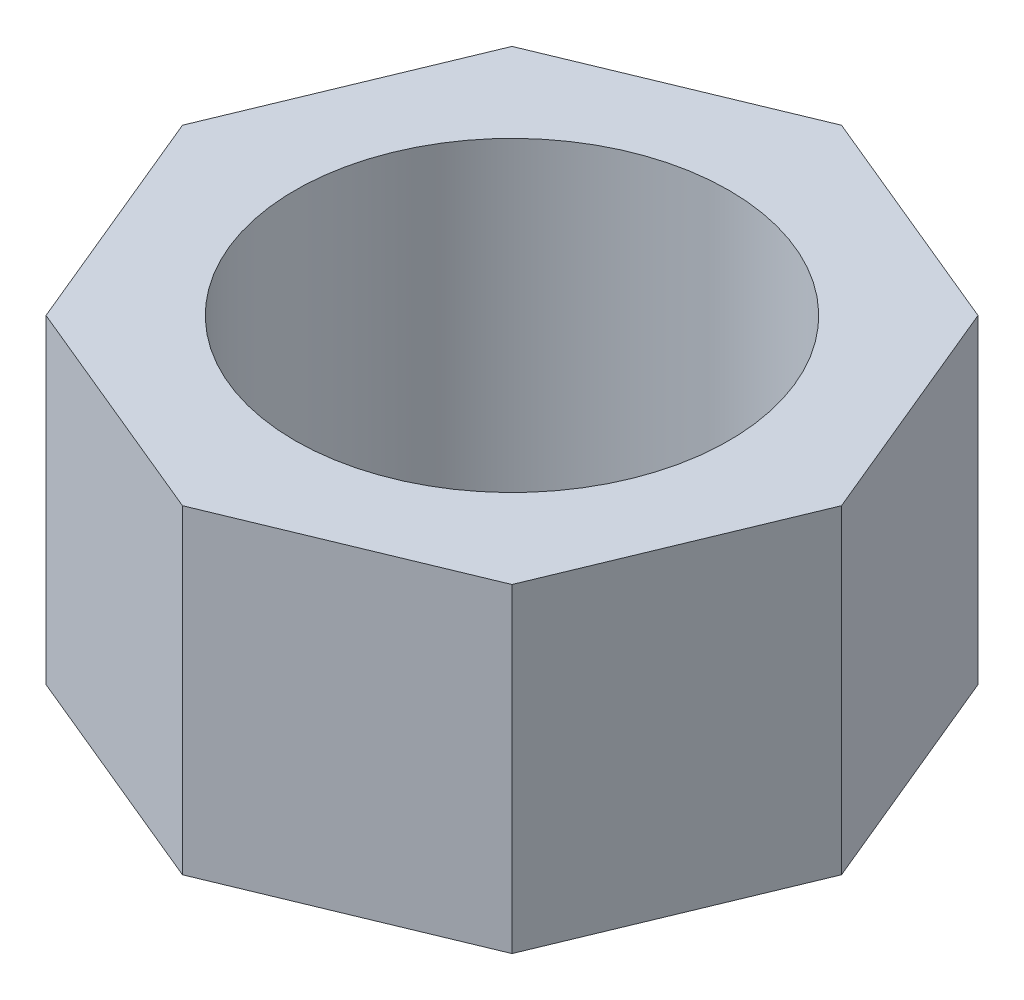
ISO-10303-21;
HEADER;
FILE_DESCRIPTION(('STEP AP214'),'2;1');
FILE_NAME('part.step','',(''),(''),'','','');
FILE_SCHEMA(('AUTOMOTIVE_DESIGN { 1 0 10303 214 1 1 1 1 }'));
ENDSEC;
DATA;
#1=APPLICATION_CONTEXT('core data for automotive mechanical design processes');
#2=APPLICATION_PROTOCOL_DEFINITION('international standard','automotive_design',2000,#1);
#3=PRODUCT_CONTEXT('',#1,'mechanical');
#4=PRODUCT('Part','Part','',(#3));
#5=PRODUCT_RELATED_PRODUCT_CATEGORY('part','',(#4));
#6=PRODUCT_DEFINITION_FORMATION('','',#4);
#7=PRODUCT_DEFINITION_CONTEXT('part definition',#1,'design');
#8=PRODUCT_DEFINITION('design','',#6,#7);
#9=PRODUCT_DEFINITION_SHAPE('','',#8);
#10=(LENGTH_UNIT() NAMED_UNIT(*) SI_UNIT(.MILLI.,.METRE.));
#11=(NAMED_UNIT(*) PLANE_ANGLE_UNIT() SI_UNIT($,.RADIAN.));
#12=(NAMED_UNIT(*) SI_UNIT($,.STERADIAN.) SOLID_ANGLE_UNIT());
#13=UNCERTAINTY_MEASURE_WITH_UNIT(LENGTH_MEASURE(1.E-05),#10,'distance_accuracy_value','');
#14=(GEOMETRIC_REPRESENTATION_CONTEXT(3) GLOBAL_UNCERTAINTY_ASSIGNED_CONTEXT((#13)) GLOBAL_UNIT_ASSIGNED_CONTEXT((#10,
#11,#12)) REPRESENTATION_CONTEXT('',''));
#15=CARTESIAN_POINT('',(0.,0.,0.));
#16=DIRECTION('',(0.,0.,1.));
#17=DIRECTION('',(1.,0.,0.));
#18=AXIS2_PLACEMENT_3D('',#15,#16,#17);
#19=CARTESIAN_POINT('',(7.39103626009029,8.4,-3.06146745892071));
#20=DIRECTION('',(-0.923879532511287,0.,0.382683432365089));
#21=DIRECTION('',(0.382683432365089,0.,0.923879532511287));
#22=AXIS2_PLACEMENT_3D('',#19,#20,#21);
#23=PLANE('',#22);
#24=DIRECTION('',(-0.382683432365089,0.,-0.923879532511287));
#25=VECTOR('',#24,1.);
#26=CARTESIAN_POINT('',(7.39103626009029,0.,-3.06146745892071));
#27=LINE('',#26,#25);
#28=CARTESIAN_POINT('',(8.65913760233915,0.,0.));
#29=VERTEX_POINT('',#28);
#30=CARTESIAN_POINT('',(6.12293491784144,0.,-6.12293491784143));
#31=VERTEX_POINT('',#30);
#32=EDGE_CURVE('E137',#29,#31,#27,.T.);
#33=ORIENTED_EDGE('',*,*,#32,.T.);
#34=DIRECTION('',(0.,-1.,0.));
#35=VECTOR('',#34,1.);
#36=CARTESIAN_POINT('',(6.12293491784144,8.4,-6.12293491784143));
#37=LINE('',#36,#35);
#38=CARTESIAN_POINT('',(6.12293491784144,8.4,-6.12293491784143));
#39=VERTEX_POINT('',#38);
#40=EDGE_CURVE('E11',#39,#31,#37,.T.);
#41=ORIENTED_EDGE('',*,*,#40,.F.);
#42=DIRECTION('',(-0.382683432365089,0.,-0.923879532511287));
#43=VECTOR('',#42,1.);
#44=CARTESIAN_POINT('',(7.39103626009029,8.4,-3.06146745892071));
#45=LINE('',#44,#43);
#46=CARTESIAN_POINT('',(8.65913760233915,8.4,0.));
#47=VERTEX_POINT('',#46);
#48=EDGE_CURVE('E183',#47,#39,#45,.T.);
#49=ORIENTED_EDGE('',*,*,#48,.F.);
#50=DIRECTION('',(0.,-1.,0.));
#51=VECTOR('',#50,1.);
#52=CARTESIAN_POINT('',(8.65913760233915,8.4,0.));
#53=LINE('',#52,#51);
#54=EDGE_CURVE('E130',#47,#29,#53,.T.);
#55=ORIENTED_EDGE('',*,*,#54,.T.);
#56=EDGE_LOOP('',(#33,#41,#49,#55));
#57=FACE_BOUND('',#56,.T.);
#58=ADVANCED_FACE('F37',(#57),#23,.F.);
#59=CARTESIAN_POINT('',(3.06146745892066,8.4,-7.39103626009029));
#60=DIRECTION('',(-0.382683432365084,0.,0.923879532511289));
#61=DIRECTION('',(0.923879532511289,0.,0.382683432365084));
#62=AXIS2_PLACEMENT_3D('',#59,#60,#61);
#63=PLANE('',#62);
#64=DIRECTION('',(-0.923879532511289,0.,-0.382683432365084));
#65=VECTOR('',#64,1.);
#66=CARTESIAN_POINT('',(3.06146745892066,0.,-7.39103626009029));
#67=LINE('',#66,#65);
#68=CARTESIAN_POINT('',(-1.1145598333151E-13,0.,-8.65913760233915));
#69=VERTEX_POINT('',#68);
#70=EDGE_CURVE('E140',#31,#69,#67,.T.);
#71=ORIENTED_EDGE('',*,*,#70,.T.);
#72=DIRECTION('',(0.,-1.,0.));
#73=VECTOR('',#72,1.);
#74=CARTESIAN_POINT('',(-1.1145598333151E-13,8.4,-8.65913760233915));
#75=LINE('',#74,#73);
#76=CARTESIAN_POINT('',(-1.1145598333151E-13,8.4,-8.65913760233915));
#77=VERTEX_POINT('',#76);
#78=EDGE_CURVE('E46',#77,#69,#75,.T.);
#79=ORIENTED_EDGE('',*,*,#78,.F.);
#80=DIRECTION('',(-0.923879532511289,0.,-0.382683432365084));
#81=VECTOR('',#80,1.);
#82=CARTESIAN_POINT('',(3.06146745892066,8.4,-7.39103626009029));
#83=LINE('',#82,#81);
#84=EDGE_CURVE('E97',#39,#77,#83,.T.);
#85=ORIENTED_EDGE('',*,*,#84,.F.);
#86=ORIENTED_EDGE('',*,*,#40,.T.);
#87=EDGE_LOOP('',(#71,#79,#85,#86));
#88=FACE_BOUND('',#87,.T.);
#89=ADVANCED_FACE('F201',(#88),#63,.F.);
#90=CARTESIAN_POINT('',(-3.06146745892077,8.4,-7.39103626009029));
#91=DIRECTION('',(0.382683432365096,0.,0.923879532511285));
#92=DIRECTION('',(0.923879532511284,0.,-0.382683432365096));
#93=AXIS2_PLACEMENT_3D('',#90,#91,#92);
#94=PLANE('',#93);
#95=DIRECTION('',(-0.923879532511284,0.,0.382683432365096));
#96=VECTOR('',#95,1.);
#97=CARTESIAN_POINT('',(-3.06146745892077,0.,-7.39103626009029));
#98=LINE('',#97,#96);
#99=CARTESIAN_POINT('',(-6.12293491784143,0.,-6.12293491784144));
#100=VERTEX_POINT('',#99);
#101=EDGE_CURVE('E142',#69,#100,#98,.T.);
#102=ORIENTED_EDGE('',*,*,#101,.T.);
#103=DIRECTION('',(0.,-1.,0.));
#104=VECTOR('',#103,1.);
#105=CARTESIAN_POINT('',(-6.12293491784143,8.4,-6.12293491784144));
#106=LINE('',#105,#104);
#107=CARTESIAN_POINT('',(-6.12293491784143,8.4,-6.12293491784144));
#108=VERTEX_POINT('',#107);
#109=EDGE_CURVE('E158',#108,#100,#106,.T.);
#110=ORIENTED_EDGE('',*,*,#109,.F.);
#111=DIRECTION('',(-0.923879532511284,0.,0.382683432365096));
#112=VECTOR('',#111,1.);
#113=CARTESIAN_POINT('',(-3.06146745892077,8.4,-7.39103626009029));
#114=LINE('',#113,#112);
#115=EDGE_CURVE('E166',#77,#108,#114,.T.);
#116=ORIENTED_EDGE('',*,*,#115,.F.);
#117=ORIENTED_EDGE('',*,*,#78,.T.);
#118=EDGE_LOOP('',(#102,#110,#116,#117));
#119=FACE_BOUND('',#118,.T.);
#120=ADVANCED_FACE('F164',(#119),#94,.F.);
#121=CARTESIAN_POINT('',(-7.39103626009029,8.4,-3.06146745892072));
#122=DIRECTION('',(0.923879532511287,0.,0.38268343236509));
#123=DIRECTION('',(0.38268343236509,0.,-0.923879532511287));
#124=AXIS2_PLACEMENT_3D('',#121,#122,#123);
#125=PLANE('',#124);
#126=DIRECTION('',(-0.38268343236509,0.,0.923879532511287));
#127=VECTOR('',#126,1.);
#128=CARTESIAN_POINT('',(-7.39103626009029,0.,-3.06146745892072));
#129=LINE('',#128,#127);
#130=CARTESIAN_POINT('',(-8.65913760233915,0.,0.));
#131=VERTEX_POINT('',#130);
#132=EDGE_CURVE('E144',#100,#131,#129,.T.);
#133=ORIENTED_EDGE('',*,*,#132,.T.);
#134=DIRECTION('',(0.,-1.,0.));
#135=VECTOR('',#134,1.);
#136=CARTESIAN_POINT('',(-8.65913760233915,8.4,0.));
#137=LINE('',#136,#135);
#138=CARTESIAN_POINT('',(-8.65913760233915,8.4,0.));
#139=VERTEX_POINT('',#138);
#140=EDGE_CURVE('E155',#139,#131,#137,.T.);
#141=ORIENTED_EDGE('',*,*,#140,.F.);
#142=DIRECTION('',(-0.38268343236509,0.,0.923879532511287));
#143=VECTOR('',#142,1.);
#144=CARTESIAN_POINT('',(-7.39103626009029,8.4,-3.06146745892072));
#145=LINE('',#144,#143);
#146=EDGE_CURVE('E178',#108,#139,#145,.T.);
#147=ORIENTED_EDGE('',*,*,#146,.F.);
#148=ORIENTED_EDGE('',*,*,#109,.T.);
#149=EDGE_LOOP('',(#133,#141,#147,#148));
#150=FACE_BOUND('',#149,.T.);
#151=ADVANCED_FACE('F174',(#150),#125,.F.);
#152=CARTESIAN_POINT('',(-7.39103626009029,8.4,3.06146745892072));
#153=DIRECTION('',(0.923879532511287,0.,-0.38268343236509));
#154=DIRECTION('',(-0.38268343236509,0.,-0.923879532511287));
#155=AXIS2_PLACEMENT_3D('',#152,#153,#154);
#156=PLANE('',#155);
#157=DIRECTION('',(0.38268343236509,0.,0.923879532511287));
#158=VECTOR('',#157,1.);
#159=CARTESIAN_POINT('',(-7.39103626009029,0.,3.06146745892072));
#160=LINE('',#159,#158);
#161=CARTESIAN_POINT('',(-6.12293491784143,0.,6.12293491784143));
#162=VERTEX_POINT('',#161);
#163=EDGE_CURVE('E146',#131,#162,#160,.T.);
#164=ORIENTED_EDGE('',*,*,#163,.T.);
#165=DIRECTION('',(0.,-1.,0.));
#166=VECTOR('',#165,1.);
#167=CARTESIAN_POINT('',(-6.12293491784143,8.4,6.12293491784143));
#168=LINE('',#167,#166);
#169=CARTESIAN_POINT('',(-6.12293491784143,8.4,6.12293491784143));
#170=VERTEX_POINT('',#169);
#171=EDGE_CURVE('E125',#170,#162,#168,.T.);
#172=ORIENTED_EDGE('',*,*,#171,.F.);
#173=DIRECTION('',(0.38268343236509,0.,0.923879532511287));
#174=VECTOR('',#173,1.);
#175=CARTESIAN_POINT('',(-7.39103626009029,8.4,3.06146745892072));
#176=LINE('',#175,#174);
#177=EDGE_CURVE('E116',#139,#170,#176,.T.);
#178=ORIENTED_EDGE('',*,*,#177,.F.);
#179=ORIENTED_EDGE('',*,*,#140,.T.);
#180=EDGE_LOOP('',(#164,#172,#178,#179));
#181=FACE_BOUND('',#180,.T.);
#182=ADVANCED_FACE('F177',(#181),#156,.F.);
#183=CARTESIAN_POINT('',(-3.06146745892072,8.4,7.39103626009029));
#184=DIRECTION('',(0.38268343236509,0.,-0.923879532511287));
#185=DIRECTION('',(-0.923879532511287,0.,-0.38268343236509));
#186=AXIS2_PLACEMENT_3D('',#183,#184,#185);
#187=PLANE('',#186);
#188=DIRECTION('',(0.923879532511287,0.,0.38268343236509));
#189=VECTOR('',#188,1.);
#190=CARTESIAN_POINT('',(-3.06146745892072,0.,7.39103626009029));
#191=LINE('',#190,#189);
#192=CARTESIAN_POINT('',(0.,0.,8.65913760233915));
#193=VERTEX_POINT('',#192);
#194=EDGE_CURVE('E124',#162,#193,#191,.T.);
#195=ORIENTED_EDGE('',*,*,#194,.T.);
#196=DIRECTION('',(0.,-1.,0.));
#197=VECTOR('',#196,1.);
#198=CARTESIAN_POINT('',(0.,8.4,8.65913760233915));
#199=LINE('',#198,#197);
#200=CARTESIAN_POINT('',(0.,8.4,8.65913760233915));
#201=VERTEX_POINT('',#200);
#202=EDGE_CURVE('E121',#201,#193,#199,.T.);
#203=ORIENTED_EDGE('',*,*,#202,.F.);
#204=DIRECTION('',(0.923879532511287,0.,0.38268343236509));
#205=VECTOR('',#204,1.);
#206=CARTESIAN_POINT('',(-3.06146745892072,8.4,7.39103626009029));
#207=LINE('',#206,#205);
#208=EDGE_CURVE('E110',#170,#201,#207,.T.);
#209=ORIENTED_EDGE('',*,*,#208,.F.);
#210=ORIENTED_EDGE('',*,*,#171,.T.);
#211=EDGE_LOOP('',(#195,#203,#209,#210));
#212=FACE_BOUND('',#211,.T.);
#213=ADVANCED_FACE('F122',(#212),#187,.F.);
#214=CARTESIAN_POINT('',(3.06146745892071,8.4,7.39103626009029));
#215=DIRECTION('',(-0.38268343236509,0.,-0.923879532511287));
#216=DIRECTION('',(-0.923879532511287,0.,0.38268343236509));
#217=AXIS2_PLACEMENT_3D('',#214,#215,#216);
#218=PLANE('',#217);
#219=DIRECTION('',(0.923879532511287,0.,-0.38268343236509));
#220=VECTOR('',#219,1.);
#221=CARTESIAN_POINT('',(3.06146745892071,0.,7.39103626009029));
#222=LINE('',#221,#220);
#223=CARTESIAN_POINT('',(6.12293491784143,0.,6.12293491784143));
#224=VERTEX_POINT('',#223);
#225=EDGE_CURVE('E83',#193,#224,#222,.T.);
#226=ORIENTED_EDGE('',*,*,#225,.T.);
#227=DIRECTION('',(0.,-1.,0.));
#228=VECTOR('',#227,1.);
#229=CARTESIAN_POINT('',(6.12293491784143,8.4,6.12293491784143));
#230=LINE('',#229,#228);
#231=CARTESIAN_POINT('',(6.12293491784143,8.4,6.12293491784143));
#232=VERTEX_POINT('',#231);
#233=EDGE_CURVE('E126',#232,#224,#230,.T.);
#234=ORIENTED_EDGE('',*,*,#233,.F.);
#235=DIRECTION('',(0.923879532511287,0.,-0.38268343236509));
#236=VECTOR('',#235,1.);
#237=CARTESIAN_POINT('',(3.06146745892071,8.4,7.39103626009029));
#238=LINE('',#237,#236);
#239=EDGE_CURVE('E114',#201,#232,#238,.T.);
#240=ORIENTED_EDGE('',*,*,#239,.F.);
#241=ORIENTED_EDGE('',*,*,#202,.T.);
#242=EDGE_LOOP('',(#226,#234,#240,#241));
#243=FACE_BOUND('',#242,.T.);
#244=ADVANCED_FACE('F128',(#243),#218,.F.);
#245=CARTESIAN_POINT('',(0.,8.4,0.));
#246=DIRECTION('',(0.,-1.,0.));
#247=DIRECTION('',(0.,0.,-1.));
#248=AXIS2_PLACEMENT_3D('',#245,#246,#247);
#249=CYLINDRICAL_SURFACE('',#248,5.7);
#250=CARTESIAN_POINT('',(0.,8.4,0.));
#251=DIRECTION('',(0.,1.,0.));
#252=DIRECTION('',(0.,0.,1.));
#253=AXIS2_PLACEMENT_3D('',#250,#251,#252);
#254=CIRCLE('',#253,5.7);
#255=CARTESIAN_POINT('',(0.,8.4,5.7));
#256=VERTEX_POINT('',#255);
#257=EDGE_CURVE('E151',#256,#256,#254,.T.);
#258=ORIENTED_EDGE('',*,*,#257,.T.);
#259=EDGE_LOOP('',(#258));
#260=FACE_BOUND('',#259,.T.);
#261=CARTESIAN_POINT('',(0.,0.,0.));
#262=DIRECTION('',(0.,1.,0.));
#263=DIRECTION('',(0.,0.,1.));
#264=AXIS2_PLACEMENT_3D('',#261,#262,#263);
#265=CIRCLE('',#264,5.7);
#266=CARTESIAN_POINT('',(0.,0.,5.7));
#267=VERTEX_POINT('',#266);
#268=EDGE_CURVE('E134',#267,#267,#265,.T.);
#269=ORIENTED_EDGE('',*,*,#268,.F.);
#270=EDGE_LOOP('',(#269));
#271=FACE_BOUND('',#270,.T.);
#272=ADVANCED_FACE('F39',(#260,#271),#249,.F.);
#273=CARTESIAN_POINT('',(7.39103626009029,8.4,3.06146745892072));
#274=DIRECTION('',(-0.923879532511287,0.,-0.38268343236509));
#275=DIRECTION('',(-0.38268343236509,0.,0.923879532511287));
#276=AXIS2_PLACEMENT_3D('',#273,#274,#275);
#277=PLANE('',#276);
#278=DIRECTION('',(0.38268343236509,0.,-0.923879532511287));
#279=VECTOR('',#278,1.);
#280=CARTESIAN_POINT('',(7.39103626009029,0.,3.06146745892072));
#281=LINE('',#280,#279);
#282=EDGE_CURVE('E89',#224,#29,#281,.T.);
#283=ORIENTED_EDGE('',*,*,#282,.T.);
#284=ORIENTED_EDGE('',*,*,#54,.F.);
#285=DIRECTION('',(0.38268343236509,0.,-0.923879532511287));
#286=VECTOR('',#285,1.);
#287=CARTESIAN_POINT('',(7.39103626009029,8.4,3.06146745892072));
#288=LINE('',#287,#286);
#289=EDGE_CURVE('E54',#232,#47,#288,.T.);
#290=ORIENTED_EDGE('',*,*,#289,.F.);
#291=ORIENTED_EDGE('',*,*,#233,.T.);
#292=EDGE_LOOP('',(#283,#284,#290,#291));
#293=FACE_BOUND('',#292,.T.);
#294=ADVANCED_FACE('F191',(#293),#277,.F.);
#295=CARTESIAN_POINT('',(0.,8.4,0.));
#296=DIRECTION('',(0.,1.,0.));
#297=DIRECTION('',(0.,0.,1.));
#298=AXIS2_PLACEMENT_3D('',#295,#296,#297);
#299=PLANE('',#298);
#300=ORIENTED_EDGE('',*,*,#257,.F.);
#301=EDGE_LOOP('',(#300));
#302=FACE_BOUND('',#301,.T.);
#303=ORIENTED_EDGE('',*,*,#48,.T.);
#304=ORIENTED_EDGE('',*,*,#84,.T.);
#305=ORIENTED_EDGE('',*,*,#115,.T.);
#306=ORIENTED_EDGE('',*,*,#146,.T.);
#307=ORIENTED_EDGE('',*,*,#177,.T.);
#308=ORIENTED_EDGE('',*,*,#208,.T.);
#309=ORIENTED_EDGE('',*,*,#239,.T.);
#310=ORIENTED_EDGE('',*,*,#289,.T.);
#311=EDGE_LOOP('',(#303,#304,#305,#306,#307,#308,#309,#310));
#312=FACE_BOUND('',#311,.T.);
#313=ADVANCED_FACE('F112',(#302,#312),#299,.T.);
#314=CARTESIAN_POINT('',(0.,0.,0.));
#315=DIRECTION('',(0.,1.,0.));
#316=DIRECTION('',(0.,0.,1.));
#317=AXIS2_PLACEMENT_3D('',#314,#315,#316);
#318=PLANE('',#317);
#319=ORIENTED_EDGE('',*,*,#268,.T.);
#320=EDGE_LOOP('',(#319));
#321=FACE_BOUND('',#320,.T.);
#322=ORIENTED_EDGE('',*,*,#32,.F.);
#323=ORIENTED_EDGE('',*,*,#282,.F.);
#324=ORIENTED_EDGE('',*,*,#225,.F.);
#325=ORIENTED_EDGE('',*,*,#194,.F.);
#326=ORIENTED_EDGE('',*,*,#163,.F.);
#327=ORIENTED_EDGE('',*,*,#132,.F.);
#328=ORIENTED_EDGE('',*,*,#101,.F.);
#329=ORIENTED_EDGE('',*,*,#70,.F.);
#330=EDGE_LOOP('',(#322,#323,#324,#325,#326,#327,#328,#329));
#331=FACE_BOUND('',#330,.T.);
#332=ADVANCED_FACE('F170',(#321,#331),#318,.F.);
#333=CLOSED_SHELL('',(#58,#89,#120,#151,#182,#213,#244,#272,#294,#313,#332));
#334=MANIFOLD_SOLID_BREP('B2',#333);
#335=ADVANCED_BREP_SHAPE_REPRESENTATION('',(#18,#334),#14);
#336=SHAPE_DEFINITION_REPRESENTATION(#9,#335);
ENDSEC;
END-ISO-10303-21;
